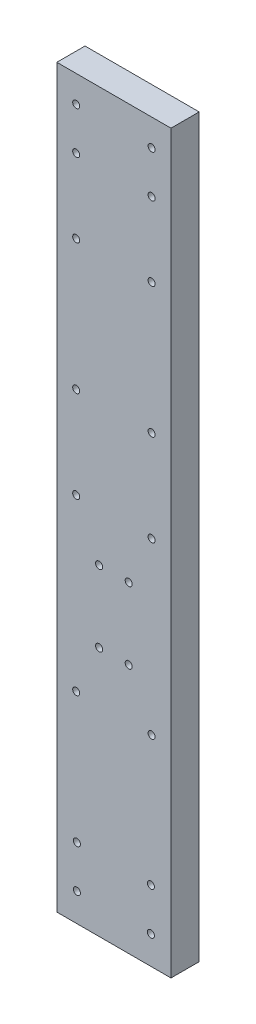
ISO-10303-21;
HEADER;
FILE_DESCRIPTION(('STEP AP214'),'2;1');
FILE_NAME('part.step','',(''),(''),'','','');
FILE_SCHEMA(('AUTOMOTIVE_DESIGN { 1 0 10303 214 1 1 1 1 }'));
ENDSEC;
DATA;
#1=APPLICATION_CONTEXT('core data for automotive mechanical design processes');
#2=APPLICATION_PROTOCOL_DEFINITION('international standard','automotive_design',2000,#1);
#3=PRODUCT_CONTEXT('',#1,'mechanical');
#4=PRODUCT('Part','Part','',(#3));
#5=PRODUCT_RELATED_PRODUCT_CATEGORY('part','',(#4));
#6=PRODUCT_DEFINITION_FORMATION('','',#4);
#7=PRODUCT_DEFINITION_CONTEXT('part definition',#1,'design');
#8=PRODUCT_DEFINITION('design','',#6,#7);
#9=PRODUCT_DEFINITION_SHAPE('','',#8);
#10=(LENGTH_UNIT() NAMED_UNIT(*) SI_UNIT(.MILLI.,.METRE.));
#11=(NAMED_UNIT(*) PLANE_ANGLE_UNIT() SI_UNIT($,.RADIAN.));
#12=(NAMED_UNIT(*) SI_UNIT($,.STERADIAN.) SOLID_ANGLE_UNIT());
#13=UNCERTAINTY_MEASURE_WITH_UNIT(LENGTH_MEASURE(1.E-05),#10,'distance_accuracy_value','');
#14=(GEOMETRIC_REPRESENTATION_CONTEXT(3) GLOBAL_UNCERTAINTY_ASSIGNED_CONTEXT((#13)) GLOBAL_UNIT_ASSIGNED_CONTEXT((#10,
#11,#12)) REPRESENTATION_CONTEXT('',''));
#15=CARTESIAN_POINT('',(0.,0.,0.));
#16=DIRECTION('',(0.,0.,1.));
#17=DIRECTION('',(1.,0.,0.));
#18=AXIS2_PLACEMENT_3D('',#15,#16,#17);
#19=CARTESIAN_POINT('',(0.,0.,4.));
#20=DIRECTION('',(0.,0.,-1.));
#21=DIRECTION('',(-1.,0.,0.));
#22=AXIS2_PLACEMENT_3D('',#19,#20,#21);
#23=PLANE('',#22);
#24=CARTESIAN_POINT('',(13.4499999999989,100.665,4.));
#25=DIRECTION('',(0.,0.,1.));
#26=DIRECTION('',(-1.,0.,0.));
#27=AXIS2_PLACEMENT_3D('',#24,#25,#26);
#28=CIRCLE('',#27,0.499999999999998);
#29=CARTESIAN_POINT('',(12.9499999999989,100.665,4.));
#30=VERTEX_POINT('',#29);
#31=EDGE_CURVE('E217',#30,#30,#28,.T.);
#32=ORIENTED_EDGE('',*,*,#31,.F.);
#33=EDGE_LOOP('',(#32));
#34=FACE_BOUND('',#33,.T.);
#35=CARTESIAN_POINT('',(13.350000000001,10.,4.));
#36=DIRECTION('',(0.,0.,1.));
#37=DIRECTION('',(-1.,0.,0.));
#38=AXIS2_PLACEMENT_3D('',#35,#36,#37);
#39=CIRCLE('',#38,0.499999999999997);
#40=CARTESIAN_POINT('',(12.850000000001,10.,4.));
#41=VERTEX_POINT('',#40);
#42=EDGE_CURVE('E205',#41,#41,#39,.T.);
#43=ORIENTED_EDGE('',*,*,#42,.F.);
#44=EDGE_LOOP('',(#43));
#45=FACE_BOUND('',#44,.T.);
#46=CARTESIAN_POINT('',(2.85,10.,4.));
#47=DIRECTION('',(0.,0.,1.));
#48=DIRECTION('',(1.,0.,0.));
#49=AXIS2_PLACEMENT_3D('',#46,#47,#48);
#50=CIRCLE('',#49,0.499999999999999);
#51=CARTESIAN_POINT('',(3.35,10.,4.));
#52=VERTEX_POINT('',#51);
#53=EDGE_CURVE('E193',#52,#52,#50,.T.);
#54=ORIENTED_EDGE('',*,*,#53,.F.);
#55=EDGE_LOOP('',(#54));
#56=FACE_BOUND('',#55,.T.);
#57=CARTESIAN_POINT('',(13.4499999999999,94.665,4.));
#58=DIRECTION('',(0.,0.,1.));
#59=DIRECTION('',(1.,0.,0.));
#60=AXIS2_PLACEMENT_3D('',#57,#58,#59);
#61=CIRCLE('',#60,0.499999999999998);
#62=CARTESIAN_POINT('',(13.9499999999999,94.665,4.));
#63=VERTEX_POINT('',#62);
#64=EDGE_CURVE('E181',#63,#63,#61,.T.);
#65=ORIENTED_EDGE('',*,*,#64,.F.);
#66=EDGE_LOOP('',(#65));
#67=FACE_BOUND('',#66,.T.);
#68=CARTESIAN_POINT('',(13.4499999999987,84.165,4.));
#69=DIRECTION('',(0.,0.,1.));
#70=DIRECTION('',(1.,0.,0.));
#71=AXIS2_PLACEMENT_3D('',#68,#69,#70);
#72=CIRCLE('',#71,0.499999999999998);
#73=CARTESIAN_POINT('',(13.9499999999987,84.165,4.));
#74=VERTEX_POINT('',#73);
#75=EDGE_CURVE('E169',#74,#74,#72,.T.);
#76=ORIENTED_EDGE('',*,*,#75,.F.);
#77=EDGE_LOOP('',(#76));
#78=FACE_BOUND('',#77,.T.);
#79=CARTESIAN_POINT('',(13.45,28.5,4.));
#80=DIRECTION('',(0.,0.,1.));
#81=DIRECTION('',(1.,0.,0.));
#82=AXIS2_PLACEMENT_3D('',#79,#80,#81);
#83=CIRCLE('',#82,0.499999999999995);
#84=CARTESIAN_POINT('',(13.95,28.5,4.));
#85=VERTEX_POINT('',#84);
#86=EDGE_CURVE('E157',#85,#85,#83,.T.);
#87=ORIENTED_EDGE('',*,*,#86,.F.);
#88=EDGE_LOOP('',(#87));
#89=FACE_BOUND('',#88,.T.);
#90=CARTESIAN_POINT('',(10.2,35.5,4.));
#91=DIRECTION('',(0.,0.,1.));
#92=DIRECTION('',(1.,0.,0.));
#93=AXIS2_PLACEMENT_3D('',#90,#91,#92);
#94=CIRCLE('',#93,0.499999999999999);
#95=CARTESIAN_POINT('',(10.7,35.5,4.));
#96=VERTEX_POINT('',#95);
#97=EDGE_CURVE('E145',#96,#96,#94,.T.);
#98=ORIENTED_EDGE('',*,*,#97,.F.);
#99=EDGE_LOOP('',(#98));
#100=FACE_BOUND('',#99,.T.);
#101=CARTESIAN_POINT('',(13.4500000000003,65.64,4.));
#102=DIRECTION('',(0.,0.,1.));
#103=DIRECTION('',(1.,0.,0.));
#104=AXIS2_PLACEMENT_3D('',#101,#102,#103);
#105=CIRCLE('',#104,0.499999999999998);
#106=CARTESIAN_POINT('',(13.9500000000003,65.64,4.));
#107=VERTEX_POINT('',#106);
#108=EDGE_CURVE('E133',#107,#107,#105,.T.);
#109=ORIENTED_EDGE('',*,*,#108,.F.);
#110=EDGE_LOOP('',(#109));
#111=FACE_BOUND('',#110,.T.);
#112=CARTESIAN_POINT('',(13.45,52.64,4.));
#113=DIRECTION('',(0.,0.,1.));
#114=DIRECTION('',(1.,0.,0.));
#115=AXIS2_PLACEMENT_3D('',#112,#113,#114);
#116=CIRCLE('',#115,0.499999999999999);
#117=CARTESIAN_POINT('',(13.95,52.64,4.));
#118=VERTEX_POINT('',#117);
#119=EDGE_CURVE('E121',#118,#118,#116,.T.);
#120=ORIENTED_EDGE('',*,*,#119,.F.);
#121=EDGE_LOOP('',(#120));
#122=FACE_BOUND('',#121,.T.);
#123=CARTESIAN_POINT('',(10.2,45.64,4.));
#124=DIRECTION('',(0.,0.,1.));
#125=DIRECTION('',(1.,0.,0.));
#126=AXIS2_PLACEMENT_3D('',#123,#124,#125);
#127=CIRCLE('',#126,0.499999999999999);
#128=CARTESIAN_POINT('',(10.7,45.64,4.));
#129=VERTEX_POINT('',#128);
#130=EDGE_CURVE('E100',#129,#129,#127,.T.);
#131=ORIENTED_EDGE('',*,*,#130,.F.);
#132=EDGE_LOOP('',(#131));
#133=FACE_BOUND('',#132,.T.);
#134=DIRECTION('',(1.,0.,0.));
#135=VECTOR('',#134,1.);
#136=CARTESIAN_POINT('',(0.,0.,4.));
#137=LINE('',#136,#135);
#138=CARTESIAN_POINT('',(0.,0.,4.));
#139=VERTEX_POINT('',#138);
#140=CARTESIAN_POINT('',(16.2,0.,4.));
#141=VERTEX_POINT('',#140);
#142=EDGE_CURVE('E85',#139,#141,#137,.T.);
#143=ORIENTED_EDGE('',*,*,#142,.T.);
#144=DIRECTION('',(0.,1.,0.));
#145=VECTOR('',#144,1.);
#146=CARTESIAN_POINT('',(16.2,104.46,4.));
#147=LINE('',#146,#145);
#148=CARTESIAN_POINT('',(16.2,104.46,4.));
#149=VERTEX_POINT('',#148);
#150=EDGE_CURVE('E80',#141,#149,#147,.T.);
#151=ORIENTED_EDGE('',*,*,#150,.T.);
#152=DIRECTION('',(-1.,0.,0.));
#153=VECTOR('',#152,1.);
#154=CARTESIAN_POINT('',(0.,104.46,4.));
#155=LINE('',#154,#153);
#156=CARTESIAN_POINT('',(0.,104.46,4.));
#157=VERTEX_POINT('',#156);
#158=EDGE_CURVE('E83',#149,#157,#155,.T.);
#159=ORIENTED_EDGE('',*,*,#158,.T.);
#160=DIRECTION('',(0.,-1.,0.));
#161=VECTOR('',#160,1.);
#162=CARTESIAN_POINT('',(0.,104.46,4.));
#163=LINE('',#162,#161);
#164=EDGE_CURVE('E50',#157,#139,#163,.T.);
#165=ORIENTED_EDGE('',*,*,#164,.T.);
#166=EDGE_LOOP('',(#143,#151,#159,#165));
#167=FACE_BOUND('',#166,.T.);
#168=CARTESIAN_POINT('',(5.99999999999999,45.64,4.));
#169=DIRECTION('',(0.,0.,1.));
#170=DIRECTION('',(1.,0.,0.));
#171=AXIS2_PLACEMENT_3D('',#168,#169,#170);
#172=CIRCLE('',#171,0.500000000000002);
#173=CARTESIAN_POINT('',(6.5,45.64,4.));
#174=VERTEX_POINT('',#173);
#175=EDGE_CURVE('E115',#174,#174,#172,.T.);
#176=ORIENTED_EDGE('',*,*,#175,.F.);
#177=EDGE_LOOP('',(#176));
#178=FACE_BOUND('',#177,.T.);
#179=CARTESIAN_POINT('',(2.74999999999999,52.64,4.));
#180=DIRECTION('',(0.,0.,1.));
#181=DIRECTION('',(1.,0.,0.));
#182=AXIS2_PLACEMENT_3D('',#179,#180,#181);
#183=CIRCLE('',#182,0.499999999999999);
#184=CARTESIAN_POINT('',(3.24999999999999,52.64,4.));
#185=VERTEX_POINT('',#184);
#186=EDGE_CURVE('E127',#185,#185,#183,.T.);
#187=ORIENTED_EDGE('',*,*,#186,.F.);
#188=EDGE_LOOP('',(#187));
#189=FACE_BOUND('',#188,.T.);
#190=CARTESIAN_POINT('',(2.74999999999999,65.64,4.));
#191=DIRECTION('',(0.,0.,1.));
#192=DIRECTION('',(1.,0.,0.));
#193=AXIS2_PLACEMENT_3D('',#190,#191,#192);
#194=CIRCLE('',#193,0.499999999999999);
#195=CARTESIAN_POINT('',(3.24999999999999,65.64,4.));
#196=VERTEX_POINT('',#195);
#197=EDGE_CURVE('E139',#196,#196,#194,.T.);
#198=ORIENTED_EDGE('',*,*,#197,.F.);
#199=EDGE_LOOP('',(#198));
#200=FACE_BOUND('',#199,.T.);
#201=CARTESIAN_POINT('',(6.,35.5,4.));
#202=DIRECTION('',(0.,0.,1.));
#203=DIRECTION('',(1.,0.,0.));
#204=AXIS2_PLACEMENT_3D('',#201,#202,#203);
#205=CIRCLE('',#204,0.5);
#206=CARTESIAN_POINT('',(6.5,35.5,4.));
#207=VERTEX_POINT('',#206);
#208=EDGE_CURVE('E151',#207,#207,#205,.T.);
#209=ORIENTED_EDGE('',*,*,#208,.F.);
#210=EDGE_LOOP('',(#209));
#211=FACE_BOUND('',#210,.T.);
#212=CARTESIAN_POINT('',(2.75,28.5,4.));
#213=DIRECTION('',(0.,0.,1.));
#214=DIRECTION('',(1.,0.,0.));
#215=AXIS2_PLACEMENT_3D('',#212,#213,#214);
#216=CIRCLE('',#215,0.499999999999999);
#217=CARTESIAN_POINT('',(3.25,28.5,4.));
#218=VERTEX_POINT('',#217);
#219=EDGE_CURVE('E163',#218,#218,#216,.T.);
#220=ORIENTED_EDGE('',*,*,#219,.F.);
#221=EDGE_LOOP('',(#220));
#222=FACE_BOUND('',#221,.T.);
#223=CARTESIAN_POINT('',(2.74999999999866,84.165,4.));
#224=DIRECTION('',(0.,0.,1.));
#225=DIRECTION('',(1.,0.,0.));
#226=AXIS2_PLACEMENT_3D('',#223,#224,#225);
#227=CIRCLE('',#226,0.499999999999999);
#228=CARTESIAN_POINT('',(3.24999999999866,84.165,4.));
#229=VERTEX_POINT('',#228);
#230=EDGE_CURVE('E175',#229,#229,#227,.T.);
#231=ORIENTED_EDGE('',*,*,#230,.F.);
#232=EDGE_LOOP('',(#231));
#233=FACE_BOUND('',#232,.T.);
#234=CARTESIAN_POINT('',(2.74999999999866,94.665,4.));
#235=DIRECTION('',(0.,0.,1.));
#236=DIRECTION('',(1.,0.,0.));
#237=AXIS2_PLACEMENT_3D('',#234,#235,#236);
#238=CIRCLE('',#237,0.499999999999999);
#239=CARTESIAN_POINT('',(3.24999999999866,94.665,4.));
#240=VERTEX_POINT('',#239);
#241=EDGE_CURVE('E187',#240,#240,#238,.T.);
#242=ORIENTED_EDGE('',*,*,#241,.F.);
#243=EDGE_LOOP('',(#242));
#244=FACE_BOUND('',#243,.T.);
#245=CARTESIAN_POINT('',(2.85,4.,4.));
#246=DIRECTION('',(0.,0.,1.));
#247=DIRECTION('',(1.,0.,0.));
#248=AXIS2_PLACEMENT_3D('',#245,#246,#247);
#249=CIRCLE('',#248,0.499999999999999);
#250=CARTESIAN_POINT('',(3.35,4.,4.));
#251=VERTEX_POINT('',#250);
#252=EDGE_CURVE('E199',#251,#251,#249,.T.);
#253=ORIENTED_EDGE('',*,*,#252,.F.);
#254=EDGE_LOOP('',(#253));
#255=FACE_BOUND('',#254,.T.);
#256=CARTESIAN_POINT('',(13.350000000001,4.,4.));
#257=DIRECTION('',(0.,0.,1.));
#258=DIRECTION('',(-1.,0.,0.));
#259=AXIS2_PLACEMENT_3D('',#256,#257,#258);
#260=CIRCLE('',#259,0.499999999999999);
#261=CARTESIAN_POINT('',(12.850000000001,4.,4.));
#262=VERTEX_POINT('',#261);
#263=EDGE_CURVE('E211',#262,#262,#260,.T.);
#264=ORIENTED_EDGE('',*,*,#263,.F.);
#265=EDGE_LOOP('',(#264));
#266=FACE_BOUND('',#265,.T.);
#267=CARTESIAN_POINT('',(2.74999999999866,100.665,4.));
#268=DIRECTION('',(0.,0.,1.));
#269=DIRECTION('',(-1.,0.,0.));
#270=AXIS2_PLACEMENT_3D('',#267,#268,#269);
#271=CIRCLE('',#270,0.499999999999999);
#272=CARTESIAN_POINT('',(2.24999999999866,100.665,4.));
#273=VERTEX_POINT('',#272);
#274=EDGE_CURVE('E223',#273,#273,#271,.T.);
#275=ORIENTED_EDGE('',*,*,#274,.F.);
#276=EDGE_LOOP('',(#275));
#277=FACE_BOUND('',#276,.T.);
#278=ADVANCED_FACE('F33',(#34,#45,#56,#67,#78,#89,#100,#111,#122,#133,#167,#178,#189,#200,#211,
#222,#233,#244,#255,#266,#277),#23,.F.);
#279=CARTESIAN_POINT('',(0.,0.,0.));
#280=DIRECTION('',(0.,0.,-1.));
#281=DIRECTION('',(-1.,0.,0.));
#282=AXIS2_PLACEMENT_3D('',#279,#280,#281);
#283=PLANE('',#282);
#284=CARTESIAN_POINT('',(13.4499999999989,100.665,0.));
#285=DIRECTION('',(0.,0.,1.));
#286=DIRECTION('',(-1.,0.,0.));
#287=AXIS2_PLACEMENT_3D('',#284,#285,#286);
#288=CIRCLE('',#287,0.499999999999998);
#289=CARTESIAN_POINT('',(12.9499999999989,100.665,0.));
#290=VERTEX_POINT('',#289);
#291=EDGE_CURVE('E220',#290,#290,#288,.T.);
#292=ORIENTED_EDGE('',*,*,#291,.T.);
#293=EDGE_LOOP('',(#292));
#294=FACE_BOUND('',#293,.T.);
#295=CARTESIAN_POINT('',(13.350000000001,10.,0.));
#296=DIRECTION('',(0.,0.,1.));
#297=DIRECTION('',(-1.,0.,0.));
#298=AXIS2_PLACEMENT_3D('',#295,#296,#297);
#299=CIRCLE('',#298,0.499999999999997);
#300=CARTESIAN_POINT('',(12.850000000001,10.,0.));
#301=VERTEX_POINT('',#300);
#302=EDGE_CURVE('E208',#301,#301,#299,.T.);
#303=ORIENTED_EDGE('',*,*,#302,.T.);
#304=EDGE_LOOP('',(#303));
#305=FACE_BOUND('',#304,.T.);
#306=CARTESIAN_POINT('',(2.85,10.,0.));
#307=DIRECTION('',(0.,0.,1.));
#308=DIRECTION('',(1.,0.,0.));
#309=AXIS2_PLACEMENT_3D('',#306,#307,#308);
#310=CIRCLE('',#309,0.499999999999999);
#311=CARTESIAN_POINT('',(3.35,10.,0.));
#312=VERTEX_POINT('',#311);
#313=EDGE_CURVE('E196',#312,#312,#310,.T.);
#314=ORIENTED_EDGE('',*,*,#313,.T.);
#315=EDGE_LOOP('',(#314));
#316=FACE_BOUND('',#315,.T.);
#317=CARTESIAN_POINT('',(13.4499999999999,94.665,0.));
#318=DIRECTION('',(0.,0.,1.));
#319=DIRECTION('',(1.,0.,0.));
#320=AXIS2_PLACEMENT_3D('',#317,#318,#319);
#321=CIRCLE('',#320,0.499999999999998);
#322=CARTESIAN_POINT('',(13.9499999999999,94.665,0.));
#323=VERTEX_POINT('',#322);
#324=EDGE_CURVE('E184',#323,#323,#321,.T.);
#325=ORIENTED_EDGE('',*,*,#324,.T.);
#326=EDGE_LOOP('',(#325));
#327=FACE_BOUND('',#326,.T.);
#328=CARTESIAN_POINT('',(13.4499999999987,84.165,0.));
#329=DIRECTION('',(0.,0.,1.));
#330=DIRECTION('',(1.,0.,0.));
#331=AXIS2_PLACEMENT_3D('',#328,#329,#330);
#332=CIRCLE('',#331,0.499999999999998);
#333=CARTESIAN_POINT('',(13.9499999999987,84.165,0.));
#334=VERTEX_POINT('',#333);
#335=EDGE_CURVE('E172',#334,#334,#332,.T.);
#336=ORIENTED_EDGE('',*,*,#335,.T.);
#337=EDGE_LOOP('',(#336));
#338=FACE_BOUND('',#337,.T.);
#339=CARTESIAN_POINT('',(13.45,28.5,0.));
#340=DIRECTION('',(0.,0.,1.));
#341=DIRECTION('',(1.,0.,0.));
#342=AXIS2_PLACEMENT_3D('',#339,#340,#341);
#343=CIRCLE('',#342,0.499999999999995);
#344=CARTESIAN_POINT('',(13.95,28.5,0.));
#345=VERTEX_POINT('',#344);
#346=EDGE_CURVE('E160',#345,#345,#343,.T.);
#347=ORIENTED_EDGE('',*,*,#346,.T.);
#348=EDGE_LOOP('',(#347));
#349=FACE_BOUND('',#348,.T.);
#350=CARTESIAN_POINT('',(10.2,35.5,0.));
#351=DIRECTION('',(0.,0.,1.));
#352=DIRECTION('',(1.,0.,0.));
#353=AXIS2_PLACEMENT_3D('',#350,#351,#352);
#354=CIRCLE('',#353,0.499999999999999);
#355=CARTESIAN_POINT('',(10.7,35.5,0.));
#356=VERTEX_POINT('',#355);
#357=EDGE_CURVE('E148',#356,#356,#354,.T.);
#358=ORIENTED_EDGE('',*,*,#357,.T.);
#359=EDGE_LOOP('',(#358));
#360=FACE_BOUND('',#359,.T.);
#361=CARTESIAN_POINT('',(13.4500000000003,65.64,0.));
#362=DIRECTION('',(0.,0.,1.));
#363=DIRECTION('',(1.,0.,0.));
#364=AXIS2_PLACEMENT_3D('',#361,#362,#363);
#365=CIRCLE('',#364,0.499999999999998);
#366=CARTESIAN_POINT('',(13.9500000000003,65.64,0.));
#367=VERTEX_POINT('',#366);
#368=EDGE_CURVE('E136',#367,#367,#365,.T.);
#369=ORIENTED_EDGE('',*,*,#368,.T.);
#370=EDGE_LOOP('',(#369));
#371=FACE_BOUND('',#370,.T.);
#372=CARTESIAN_POINT('',(13.45,52.64,0.));
#373=DIRECTION('',(0.,0.,1.));
#374=DIRECTION('',(1.,0.,0.));
#375=AXIS2_PLACEMENT_3D('',#372,#373,#374);
#376=CIRCLE('',#375,0.499999999999999);
#377=CARTESIAN_POINT('',(13.95,52.64,0.));
#378=VERTEX_POINT('',#377);
#379=EDGE_CURVE('E124',#378,#378,#376,.T.);
#380=ORIENTED_EDGE('',*,*,#379,.T.);
#381=EDGE_LOOP('',(#380));
#382=FACE_BOUND('',#381,.T.);
#383=CARTESIAN_POINT('',(10.2,45.64,0.));
#384=DIRECTION('',(0.,0.,1.));
#385=DIRECTION('',(1.,0.,0.));
#386=AXIS2_PLACEMENT_3D('',#383,#384,#385);
#387=CIRCLE('',#386,0.499999999999999);
#388=CARTESIAN_POINT('',(10.7,45.64,0.));
#389=VERTEX_POINT('',#388);
#390=EDGE_CURVE('E112',#389,#389,#387,.T.);
#391=ORIENTED_EDGE('',*,*,#390,.T.);
#392=EDGE_LOOP('',(#391));
#393=FACE_BOUND('',#392,.T.);
#394=DIRECTION('',(1.,0.,0.));
#395=VECTOR('',#394,1.);
#396=CARTESIAN_POINT('',(0.,0.,0.));
#397=LINE('',#396,#395);
#398=CARTESIAN_POINT('',(0.,0.,0.));
#399=VERTEX_POINT('',#398);
#400=CARTESIAN_POINT('',(16.2,0.,0.));
#401=VERTEX_POINT('',#400);
#402=EDGE_CURVE('E97',#399,#401,#397,.T.);
#403=ORIENTED_EDGE('',*,*,#402,.F.);
#404=DIRECTION('',(0.,-1.,0.));
#405=VECTOR('',#404,1.);
#406=CARTESIAN_POINT('',(0.,104.46,0.));
#407=LINE('',#406,#405);
#408=CARTESIAN_POINT('',(0.,104.46,0.));
#409=VERTEX_POINT('',#408);
#410=EDGE_CURVE('E73',#409,#399,#407,.T.);
#411=ORIENTED_EDGE('',*,*,#410,.F.);
#412=DIRECTION('',(-1.,0.,0.));
#413=VECTOR('',#412,1.);
#414=CARTESIAN_POINT('',(0.,104.46,0.));
#415=LINE('',#414,#413);
#416=CARTESIAN_POINT('',(16.2,104.46,0.));
#417=VERTEX_POINT('',#416);
#418=EDGE_CURVE('E67',#417,#409,#415,.T.);
#419=ORIENTED_EDGE('',*,*,#418,.F.);
#420=DIRECTION('',(0.,1.,0.));
#421=VECTOR('',#420,1.);
#422=CARTESIAN_POINT('',(16.2,104.46,0.));
#423=LINE('',#422,#421);
#424=EDGE_CURVE('E89',#401,#417,#423,.T.);
#425=ORIENTED_EDGE('',*,*,#424,.F.);
#426=EDGE_LOOP('',(#403,#411,#419,#425));
#427=FACE_BOUND('',#426,.T.);
#428=CARTESIAN_POINT('',(5.99999999999999,45.64,0.));
#429=DIRECTION('',(0.,0.,1.));
#430=DIRECTION('',(1.,0.,0.));
#431=AXIS2_PLACEMENT_3D('',#428,#429,#430);
#432=CIRCLE('',#431,0.500000000000002);
#433=CARTESIAN_POINT('',(6.5,45.64,0.));
#434=VERTEX_POINT('',#433);
#435=EDGE_CURVE('E118',#434,#434,#432,.T.);
#436=ORIENTED_EDGE('',*,*,#435,.T.);
#437=EDGE_LOOP('',(#436));
#438=FACE_BOUND('',#437,.T.);
#439=CARTESIAN_POINT('',(2.74999999999999,52.64,0.));
#440=DIRECTION('',(0.,0.,1.));
#441=DIRECTION('',(1.,0.,0.));
#442=AXIS2_PLACEMENT_3D('',#439,#440,#441);
#443=CIRCLE('',#442,0.499999999999999);
#444=CARTESIAN_POINT('',(3.24999999999999,52.64,0.));
#445=VERTEX_POINT('',#444);
#446=EDGE_CURVE('E130',#445,#445,#443,.T.);
#447=ORIENTED_EDGE('',*,*,#446,.T.);
#448=EDGE_LOOP('',(#447));
#449=FACE_BOUND('',#448,.T.);
#450=CARTESIAN_POINT('',(2.74999999999999,65.64,0.));
#451=DIRECTION('',(0.,0.,1.));
#452=DIRECTION('',(1.,0.,0.));
#453=AXIS2_PLACEMENT_3D('',#450,#451,#452);
#454=CIRCLE('',#453,0.499999999999999);
#455=CARTESIAN_POINT('',(3.24999999999999,65.64,0.));
#456=VERTEX_POINT('',#455);
#457=EDGE_CURVE('E142',#456,#456,#454,.T.);
#458=ORIENTED_EDGE('',*,*,#457,.T.);
#459=EDGE_LOOP('',(#458));
#460=FACE_BOUND('',#459,.T.);
#461=CARTESIAN_POINT('',(6.,35.5,0.));
#462=DIRECTION('',(0.,0.,1.));
#463=DIRECTION('',(1.,0.,0.));
#464=AXIS2_PLACEMENT_3D('',#461,#462,#463);
#465=CIRCLE('',#464,0.5);
#466=CARTESIAN_POINT('',(6.5,35.5,0.));
#467=VERTEX_POINT('',#466);
#468=EDGE_CURVE('E154',#467,#467,#465,.T.);
#469=ORIENTED_EDGE('',*,*,#468,.T.);
#470=EDGE_LOOP('',(#469));
#471=FACE_BOUND('',#470,.T.);
#472=CARTESIAN_POINT('',(2.75,28.5,0.));
#473=DIRECTION('',(0.,0.,1.));
#474=DIRECTION('',(1.,0.,0.));
#475=AXIS2_PLACEMENT_3D('',#472,#473,#474);
#476=CIRCLE('',#475,0.499999999999999);
#477=CARTESIAN_POINT('',(3.25,28.5,0.));
#478=VERTEX_POINT('',#477);
#479=EDGE_CURVE('E166',#478,#478,#476,.T.);
#480=ORIENTED_EDGE('',*,*,#479,.T.);
#481=EDGE_LOOP('',(#480));
#482=FACE_BOUND('',#481,.T.);
#483=CARTESIAN_POINT('',(2.74999999999866,84.165,0.));
#484=DIRECTION('',(0.,0.,1.));
#485=DIRECTION('',(1.,0.,0.));
#486=AXIS2_PLACEMENT_3D('',#483,#484,#485);
#487=CIRCLE('',#486,0.499999999999999);
#488=CARTESIAN_POINT('',(3.24999999999866,84.165,0.));
#489=VERTEX_POINT('',#488);
#490=EDGE_CURVE('E178',#489,#489,#487,.T.);
#491=ORIENTED_EDGE('',*,*,#490,.T.);
#492=EDGE_LOOP('',(#491));
#493=FACE_BOUND('',#492,.T.);
#494=CARTESIAN_POINT('',(2.74999999999866,94.665,0.));
#495=DIRECTION('',(0.,0.,1.));
#496=DIRECTION('',(1.,0.,0.));
#497=AXIS2_PLACEMENT_3D('',#494,#495,#496);
#498=CIRCLE('',#497,0.499999999999999);
#499=CARTESIAN_POINT('',(3.24999999999866,94.665,0.));
#500=VERTEX_POINT('',#499);
#501=EDGE_CURVE('E190',#500,#500,#498,.T.);
#502=ORIENTED_EDGE('',*,*,#501,.T.);
#503=EDGE_LOOP('',(#502));
#504=FACE_BOUND('',#503,.T.);
#505=CARTESIAN_POINT('',(2.85,4.,0.));
#506=DIRECTION('',(0.,0.,1.));
#507=DIRECTION('',(1.,0.,0.));
#508=AXIS2_PLACEMENT_3D('',#505,#506,#507);
#509=CIRCLE('',#508,0.499999999999999);
#510=CARTESIAN_POINT('',(3.35,4.,0.));
#511=VERTEX_POINT('',#510);
#512=EDGE_CURVE('E202',#511,#511,#509,.T.);
#513=ORIENTED_EDGE('',*,*,#512,.T.);
#514=EDGE_LOOP('',(#513));
#515=FACE_BOUND('',#514,.T.);
#516=CARTESIAN_POINT('',(13.350000000001,4.,0.));
#517=DIRECTION('',(0.,0.,1.));
#518=DIRECTION('',(-1.,0.,0.));
#519=AXIS2_PLACEMENT_3D('',#516,#517,#518);
#520=CIRCLE('',#519,0.499999999999999);
#521=CARTESIAN_POINT('',(12.850000000001,4.,0.));
#522=VERTEX_POINT('',#521);
#523=EDGE_CURVE('E214',#522,#522,#520,.T.);
#524=ORIENTED_EDGE('',*,*,#523,.T.);
#525=EDGE_LOOP('',(#524));
#526=FACE_BOUND('',#525,.T.);
#527=CARTESIAN_POINT('',(2.74999999999866,100.665,0.));
#528=DIRECTION('',(0.,0.,1.));
#529=DIRECTION('',(-1.,0.,0.));
#530=AXIS2_PLACEMENT_3D('',#527,#528,#529);
#531=CIRCLE('',#530,0.499999999999999);
#532=CARTESIAN_POINT('',(2.24999999999866,100.665,0.));
#533=VERTEX_POINT('',#532);
#534=EDGE_CURVE('E226',#533,#533,#531,.T.);
#535=ORIENTED_EDGE('',*,*,#534,.T.);
#536=EDGE_LOOP('',(#535));
#537=FACE_BOUND('',#536,.T.);
#538=ADVANCED_FACE('F108',(#294,#305,#316,#327,#338,#349,#360,#371,#382,#393,#427,#438,#449,
#460,#471,#482,#493,#504,#515,#526,#537),#283,.T.);
#539=CARTESIAN_POINT('',(0.,0.,4.));
#540=DIRECTION('',(0.,1.,0.));
#541=DIRECTION('',(0.,0.,1.));
#542=AXIS2_PLACEMENT_3D('',#539,#540,#541);
#543=PLANE('',#542);
#544=ORIENTED_EDGE('',*,*,#402,.T.);
#545=DIRECTION('',(0.,0.,-1.));
#546=VECTOR('',#545,1.);
#547=CARTESIAN_POINT('',(16.2,0.,4.));
#548=LINE('',#547,#546);
#549=EDGE_CURVE('E11',#141,#401,#548,.T.);
#550=ORIENTED_EDGE('',*,*,#549,.F.);
#551=ORIENTED_EDGE('',*,*,#142,.F.);
#552=DIRECTION('',(0.,0.,-1.));
#553=VECTOR('',#552,1.);
#554=CARTESIAN_POINT('',(0.,0.,4.));
#555=LINE('',#554,#553);
#556=EDGE_CURVE('E93',#139,#399,#555,.T.);
#557=ORIENTED_EDGE('',*,*,#556,.T.);
#558=EDGE_LOOP('',(#544,#550,#551,#557));
#559=FACE_BOUND('',#558,.T.);
#560=ADVANCED_FACE('F35',(#559),#543,.F.);
#561=CARTESIAN_POINT('',(16.2,104.46,4.));
#562=DIRECTION('',(-1.,0.,0.));
#563=DIRECTION('',(0.,-1.,0.));
#564=AXIS2_PLACEMENT_3D('',#561,#562,#563);
#565=PLANE('',#564);
#566=ORIENTED_EDGE('',*,*,#424,.T.);
#567=DIRECTION('',(0.,0.,-1.));
#568=VECTOR('',#567,1.);
#569=CARTESIAN_POINT('',(16.2,104.46,4.));
#570=LINE('',#569,#568);
#571=EDGE_CURVE('E42',#149,#417,#570,.T.);
#572=ORIENTED_EDGE('',*,*,#571,.F.);
#573=ORIENTED_EDGE('',*,*,#150,.F.);
#574=ORIENTED_EDGE('',*,*,#549,.T.);
#575=EDGE_LOOP('',(#566,#572,#573,#574));
#576=FACE_BOUND('',#575,.T.);
#577=ADVANCED_FACE('F88',(#576),#565,.F.);
#578=CARTESIAN_POINT('',(0.,104.46,4.));
#579=DIRECTION('',(0.,-1.,0.));
#580=DIRECTION('',(0.,0.,-1.));
#581=AXIS2_PLACEMENT_3D('',#578,#579,#580);
#582=PLANE('',#581);
#583=ORIENTED_EDGE('',*,*,#418,.T.);
#584=DIRECTION('',(0.,0.,-1.));
#585=VECTOR('',#584,1.);
#586=CARTESIAN_POINT('',(0.,104.46,4.));
#587=LINE('',#586,#585);
#588=EDGE_CURVE('E90',#157,#409,#587,.T.);
#589=ORIENTED_EDGE('',*,*,#588,.F.);
#590=ORIENTED_EDGE('',*,*,#158,.F.);
#591=ORIENTED_EDGE('',*,*,#571,.T.);
#592=EDGE_LOOP('',(#583,#589,#590,#591));
#593=FACE_BOUND('',#592,.T.);
#594=ADVANCED_FACE('F91',(#593),#582,.F.);
#595=CARTESIAN_POINT('',(0.,104.46,4.));
#596=DIRECTION('',(1.,0.,0.));
#597=DIRECTION('',(0.,1.,0.));
#598=AXIS2_PLACEMENT_3D('',#595,#596,#597);
#599=PLANE('',#598);
#600=ORIENTED_EDGE('',*,*,#410,.T.);
#601=ORIENTED_EDGE('',*,*,#556,.F.);
#602=ORIENTED_EDGE('',*,*,#164,.F.);
#603=ORIENTED_EDGE('',*,*,#588,.T.);
#604=EDGE_LOOP('',(#600,#601,#602,#603));
#605=FACE_BOUND('',#604,.T.);
#606=ADVANCED_FACE('F105',(#605),#599,.F.);
#607=CARTESIAN_POINT('',(10.2,45.64,4.));
#608=DIRECTION('',(0.,0.,-1.));
#609=DIRECTION('',(-1.,0.,0.));
#610=AXIS2_PLACEMENT_3D('',#607,#608,#609);
#611=CYLINDRICAL_SURFACE('',#610,0.499999999999999);
#612=ORIENTED_EDGE('',*,*,#130,.T.);
#613=EDGE_LOOP('',(#612));
#614=FACE_BOUND('',#613,.T.);
#615=ORIENTED_EDGE('',*,*,#390,.F.);
#616=EDGE_LOOP('',(#615));
#617=FACE_BOUND('',#616,.T.);
#618=ADVANCED_FACE('F246',(#614,#617),#611,.F.);
#619=CARTESIAN_POINT('',(5.99999999999999,45.64,4.));
#620=DIRECTION('',(0.,0.,-1.));
#621=DIRECTION('',(-1.,0.,0.));
#622=AXIS2_PLACEMENT_3D('',#619,#620,#621);
#623=CYLINDRICAL_SURFACE('',#622,0.500000000000002);
#624=ORIENTED_EDGE('',*,*,#175,.T.);
#625=EDGE_LOOP('',(#624));
#626=FACE_BOUND('',#625,.T.);
#627=ORIENTED_EDGE('',*,*,#435,.F.);
#628=EDGE_LOOP('',(#627));
#629=FACE_BOUND('',#628,.T.);
#630=ADVANCED_FACE('F292',(#626,#629),#623,.F.);
#631=CARTESIAN_POINT('',(13.45,52.64,4.));
#632=DIRECTION('',(0.,0.,-1.));
#633=DIRECTION('',(-1.,0.,0.));
#634=AXIS2_PLACEMENT_3D('',#631,#632,#633);
#635=CYLINDRICAL_SURFACE('',#634,0.499999999999999);
#636=ORIENTED_EDGE('',*,*,#119,.T.);
#637=EDGE_LOOP('',(#636));
#638=FACE_BOUND('',#637,.T.);
#639=ORIENTED_EDGE('',*,*,#379,.F.);
#640=EDGE_LOOP('',(#639));
#641=FACE_BOUND('',#640,.T.);
#642=ADVANCED_FACE('F300',(#638,#641),#635,.F.);
#643=CARTESIAN_POINT('',(2.74999999999999,52.64,4.));
#644=DIRECTION('',(0.,0.,-1.));
#645=DIRECTION('',(-1.,0.,0.));
#646=AXIS2_PLACEMENT_3D('',#643,#644,#645);
#647=CYLINDRICAL_SURFACE('',#646,0.499999999999999);
#648=ORIENTED_EDGE('',*,*,#186,.T.);
#649=EDGE_LOOP('',(#648));
#650=FACE_BOUND('',#649,.T.);
#651=ORIENTED_EDGE('',*,*,#446,.F.);
#652=EDGE_LOOP('',(#651));
#653=FACE_BOUND('',#652,.T.);
#654=ADVANCED_FACE('F308',(#650,#653),#647,.F.);
#655=CARTESIAN_POINT('',(13.4500000000003,65.64,4.));
#656=DIRECTION('',(0.,0.,-1.));
#657=DIRECTION('',(-1.,0.,0.));
#658=AXIS2_PLACEMENT_3D('',#655,#656,#657);
#659=CYLINDRICAL_SURFACE('',#658,0.499999999999998);
#660=ORIENTED_EDGE('',*,*,#108,.T.);
#661=EDGE_LOOP('',(#660));
#662=FACE_BOUND('',#661,.T.);
#663=ORIENTED_EDGE('',*,*,#368,.F.);
#664=EDGE_LOOP('',(#663));
#665=FACE_BOUND('',#664,.T.);
#666=ADVANCED_FACE('F317',(#662,#665),#659,.F.);
#667=CARTESIAN_POINT('',(2.74999999999999,65.64,4.));
#668=DIRECTION('',(0.,0.,-1.));
#669=DIRECTION('',(-1.,0.,0.));
#670=AXIS2_PLACEMENT_3D('',#667,#668,#669);
#671=CYLINDRICAL_SURFACE('',#670,0.499999999999999);
#672=ORIENTED_EDGE('',*,*,#197,.T.);
#673=EDGE_LOOP('',(#672));
#674=FACE_BOUND('',#673,.T.);
#675=ORIENTED_EDGE('',*,*,#457,.F.);
#676=EDGE_LOOP('',(#675));
#677=FACE_BOUND('',#676,.T.);
#678=ADVANCED_FACE('F326',(#674,#677),#671,.F.);
#679=CARTESIAN_POINT('',(10.2,35.5,4.));
#680=DIRECTION('',(0.,0.,-1.));
#681=DIRECTION('',(-1.,0.,0.));
#682=AXIS2_PLACEMENT_3D('',#679,#680,#681);
#683=CYLINDRICAL_SURFACE('',#682,0.499999999999999);
#684=ORIENTED_EDGE('',*,*,#97,.T.);
#685=EDGE_LOOP('',(#684));
#686=FACE_BOUND('',#685,.T.);
#687=ORIENTED_EDGE('',*,*,#357,.F.);
#688=EDGE_LOOP('',(#687));
#689=FACE_BOUND('',#688,.T.);
#690=ADVANCED_FACE('F335',(#686,#689),#683,.F.);
#691=CARTESIAN_POINT('',(6.,35.5,4.));
#692=DIRECTION('',(0.,0.,-1.));
#693=DIRECTION('',(-1.,0.,0.));
#694=AXIS2_PLACEMENT_3D('',#691,#692,#693);
#695=CYLINDRICAL_SURFACE('',#694,0.5);
#696=ORIENTED_EDGE('',*,*,#208,.T.);
#697=EDGE_LOOP('',(#696));
#698=FACE_BOUND('',#697,.T.);
#699=ORIENTED_EDGE('',*,*,#468,.F.);
#700=EDGE_LOOP('',(#699));
#701=FACE_BOUND('',#700,.T.);
#702=ADVANCED_FACE('F344',(#698,#701),#695,.F.);
#703=CARTESIAN_POINT('',(13.45,28.5,4.));
#704=DIRECTION('',(0.,0.,-1.));
#705=DIRECTION('',(-1.,0.,0.));
#706=AXIS2_PLACEMENT_3D('',#703,#704,#705);
#707=CYLINDRICAL_SURFACE('',#706,0.499999999999995);
#708=ORIENTED_EDGE('',*,*,#86,.T.);
#709=EDGE_LOOP('',(#708));
#710=FACE_BOUND('',#709,.T.);
#711=ORIENTED_EDGE('',*,*,#346,.F.);
#712=EDGE_LOOP('',(#711));
#713=FACE_BOUND('',#712,.T.);
#714=ADVANCED_FACE('F353',(#710,#713),#707,.F.);
#715=CARTESIAN_POINT('',(2.75,28.5,4.));
#716=DIRECTION('',(0.,0.,-1.));
#717=DIRECTION('',(-1.,0.,0.));
#718=AXIS2_PLACEMENT_3D('',#715,#716,#717);
#719=CYLINDRICAL_SURFACE('',#718,0.499999999999999);
#720=ORIENTED_EDGE('',*,*,#219,.T.);
#721=EDGE_LOOP('',(#720));
#722=FACE_BOUND('',#721,.T.);
#723=ORIENTED_EDGE('',*,*,#479,.F.);
#724=EDGE_LOOP('',(#723));
#725=FACE_BOUND('',#724,.T.);
#726=ADVANCED_FACE('F362',(#722,#725),#719,.F.);
#727=CARTESIAN_POINT('',(13.4499999999987,84.165,4.));
#728=DIRECTION('',(0.,0.,-1.));
#729=DIRECTION('',(-1.,0.,0.));
#730=AXIS2_PLACEMENT_3D('',#727,#728,#729);
#731=CYLINDRICAL_SURFACE('',#730,0.499999999999998);
#732=ORIENTED_EDGE('',*,*,#75,.T.);
#733=EDGE_LOOP('',(#732));
#734=FACE_BOUND('',#733,.T.);
#735=ORIENTED_EDGE('',*,*,#335,.F.);
#736=EDGE_LOOP('',(#735));
#737=FACE_BOUND('',#736,.T.);
#738=ADVANCED_FACE('F371',(#734,#737),#731,.F.);
#739=CARTESIAN_POINT('',(2.74999999999866,84.165,4.));
#740=DIRECTION('',(0.,0.,-1.));
#741=DIRECTION('',(-1.,0.,0.));
#742=AXIS2_PLACEMENT_3D('',#739,#740,#741);
#743=CYLINDRICAL_SURFACE('',#742,0.499999999999999);
#744=ORIENTED_EDGE('',*,*,#230,.T.);
#745=EDGE_LOOP('',(#744));
#746=FACE_BOUND('',#745,.T.);
#747=ORIENTED_EDGE('',*,*,#490,.F.);
#748=EDGE_LOOP('',(#747));
#749=FACE_BOUND('',#748,.T.);
#750=ADVANCED_FACE('F380',(#746,#749),#743,.F.);
#751=CARTESIAN_POINT('',(13.4499999999999,94.665,4.));
#752=DIRECTION('',(0.,0.,-1.));
#753=DIRECTION('',(-1.,0.,0.));
#754=AXIS2_PLACEMENT_3D('',#751,#752,#753);
#755=CYLINDRICAL_SURFACE('',#754,0.499999999999998);
#756=ORIENTED_EDGE('',*,*,#64,.T.);
#757=EDGE_LOOP('',(#756));
#758=FACE_BOUND('',#757,.T.);
#759=ORIENTED_EDGE('',*,*,#324,.F.);
#760=EDGE_LOOP('',(#759));
#761=FACE_BOUND('',#760,.T.);
#762=ADVANCED_FACE('F389',(#758,#761),#755,.F.);
#763=CARTESIAN_POINT('',(2.74999999999866,94.665,4.));
#764=DIRECTION('',(0.,0.,-1.));
#765=DIRECTION('',(-1.,0.,0.));
#766=AXIS2_PLACEMENT_3D('',#763,#764,#765);
#767=CYLINDRICAL_SURFACE('',#766,0.499999999999999);
#768=ORIENTED_EDGE('',*,*,#241,.T.);
#769=EDGE_LOOP('',(#768));
#770=FACE_BOUND('',#769,.T.);
#771=ORIENTED_EDGE('',*,*,#501,.F.);
#772=EDGE_LOOP('',(#771));
#773=FACE_BOUND('',#772,.T.);
#774=ADVANCED_FACE('F398',(#770,#773),#767,.F.);
#775=CARTESIAN_POINT('',(2.85,10.,4.));
#776=DIRECTION('',(0.,0.,-1.));
#777=DIRECTION('',(-1.,0.,0.));
#778=AXIS2_PLACEMENT_3D('',#775,#776,#777);
#779=CYLINDRICAL_SURFACE('',#778,0.499999999999999);
#780=ORIENTED_EDGE('',*,*,#53,.T.);
#781=EDGE_LOOP('',(#780));
#782=FACE_BOUND('',#781,.T.);
#783=ORIENTED_EDGE('',*,*,#313,.F.);
#784=EDGE_LOOP('',(#783));
#785=FACE_BOUND('',#784,.T.);
#786=ADVANCED_FACE('F407',(#782,#785),#779,.F.);
#787=CARTESIAN_POINT('',(2.85,4.,4.));
#788=DIRECTION('',(0.,0.,-1.));
#789=DIRECTION('',(-1.,0.,0.));
#790=AXIS2_PLACEMENT_3D('',#787,#788,#789);
#791=CYLINDRICAL_SURFACE('',#790,0.499999999999999);
#792=ORIENTED_EDGE('',*,*,#252,.T.);
#793=EDGE_LOOP('',(#792));
#794=FACE_BOUND('',#793,.T.);
#795=ORIENTED_EDGE('',*,*,#512,.F.);
#796=EDGE_LOOP('',(#795));
#797=FACE_BOUND('',#796,.T.);
#798=ADVANCED_FACE('F416',(#794,#797),#791,.F.);
#799=CARTESIAN_POINT('',(13.350000000001,10.,4.));
#800=DIRECTION('',(0.,0.,-1.));
#801=DIRECTION('',(-1.,0.,0.));
#802=AXIS2_PLACEMENT_3D('',#799,#800,#801);
#803=CYLINDRICAL_SURFACE('',#802,0.499999999999997);
#804=ORIENTED_EDGE('',*,*,#42,.T.);
#805=EDGE_LOOP('',(#804));
#806=FACE_BOUND('',#805,.T.);
#807=ORIENTED_EDGE('',*,*,#302,.F.);
#808=EDGE_LOOP('',(#807));
#809=FACE_BOUND('',#808,.T.);
#810=ADVANCED_FACE('F425',(#806,#809),#803,.F.);
#811=CARTESIAN_POINT('',(13.350000000001,4.,4.));
#812=DIRECTION('',(0.,0.,-1.));
#813=DIRECTION('',(-1.,0.,0.));
#814=AXIS2_PLACEMENT_3D('',#811,#812,#813);
#815=CYLINDRICAL_SURFACE('',#814,0.499999999999999);
#816=ORIENTED_EDGE('',*,*,#263,.T.);
#817=EDGE_LOOP('',(#816));
#818=FACE_BOUND('',#817,.T.);
#819=ORIENTED_EDGE('',*,*,#523,.F.);
#820=EDGE_LOOP('',(#819));
#821=FACE_BOUND('',#820,.T.);
#822=ADVANCED_FACE('F434',(#818,#821),#815,.F.);
#823=CARTESIAN_POINT('',(13.4499999999989,100.665,4.));
#824=DIRECTION('',(0.,0.,-1.));
#825=DIRECTION('',(-1.,0.,0.));
#826=AXIS2_PLACEMENT_3D('',#823,#824,#825);
#827=CYLINDRICAL_SURFACE('',#826,0.499999999999998);
#828=ORIENTED_EDGE('',*,*,#31,.T.);
#829=EDGE_LOOP('',(#828));
#830=FACE_BOUND('',#829,.T.);
#831=ORIENTED_EDGE('',*,*,#291,.F.);
#832=EDGE_LOOP('',(#831));
#833=FACE_BOUND('',#832,.T.);
#834=ADVANCED_FACE('F443',(#830,#833),#827,.F.);
#835=CARTESIAN_POINT('',(2.74999999999866,100.665,4.));
#836=DIRECTION('',(0.,0.,-1.));
#837=DIRECTION('',(-1.,0.,0.));
#838=AXIS2_PLACEMENT_3D('',#835,#836,#837);
#839=CYLINDRICAL_SURFACE('',#838,0.499999999999999);
#840=ORIENTED_EDGE('',*,*,#274,.T.);
#841=EDGE_LOOP('',(#840));
#842=FACE_BOUND('',#841,.T.);
#843=ORIENTED_EDGE('',*,*,#534,.F.);
#844=EDGE_LOOP('',(#843));
#845=FACE_BOUND('',#844,.T.);
#846=ADVANCED_FACE('F232',(#842,#845),#839,.F.);
#847=CLOSED_SHELL('',(#278,#538,#560,#577,#594,#606,#618,#630,#642,#654,#666,#678,#690,#702,
#714,#726,#738,#750,#762,#774,#786,#798,#810,#822,#834,#846));
#848=MANIFOLD_SOLID_BREP('B2',#847);
#849=ADVANCED_BREP_SHAPE_REPRESENTATION('',(#18,#848),#14);
#850=SHAPE_DEFINITION_REPRESENTATION(#9,#849);
ENDSEC;
END-ISO-10303-21;
